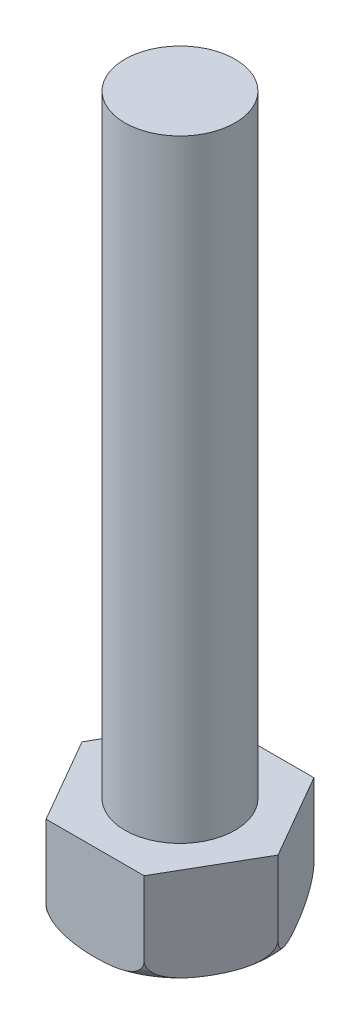
ISO-10303-21;
HEADER;
FILE_DESCRIPTION(('STEP AP214'),'2;1');
FILE_NAME('part.step','',(''),(''),'','','');
FILE_SCHEMA(('AUTOMOTIVE_DESIGN { 1 0 10303 214 1 1 1 1 }'));
ENDSEC;
DATA;
#1=APPLICATION_CONTEXT('core data for automotive mechanical design processes');
#2=APPLICATION_PROTOCOL_DEFINITION('international standard','automotive_design',2000,#1);
#3=PRODUCT_CONTEXT('',#1,'mechanical');
#4=PRODUCT('Part','Part','',(#3));
#5=PRODUCT_RELATED_PRODUCT_CATEGORY('part','',(#4));
#6=PRODUCT_DEFINITION_FORMATION('','',#4);
#7=PRODUCT_DEFINITION_CONTEXT('part definition',#1,'design');
#8=PRODUCT_DEFINITION('design','',#6,#7);
#9=PRODUCT_DEFINITION_SHAPE('','',#8);
#10=(LENGTH_UNIT() NAMED_UNIT(*) SI_UNIT(.MILLI.,.METRE.));
#11=(NAMED_UNIT(*) PLANE_ANGLE_UNIT() SI_UNIT($,.RADIAN.));
#12=(NAMED_UNIT(*) SI_UNIT($,.STERADIAN.) SOLID_ANGLE_UNIT());
#13=UNCERTAINTY_MEASURE_WITH_UNIT(LENGTH_MEASURE(1.E-05),#10,'distance_accuracy_value','');
#14=(GEOMETRIC_REPRESENTATION_CONTEXT(3) GLOBAL_UNCERTAINTY_ASSIGNED_CONTEXT((#13)) GLOBAL_UNIT_ASSIGNED_CONTEXT((#10,
#11,#12)) REPRESENTATION_CONTEXT('',''));
#15=CARTESIAN_POINT('',(0.,0.,0.));
#16=DIRECTION('',(0.,0.,1.));
#17=DIRECTION('',(1.,0.,0.));
#18=AXIS2_PLACEMENT_3D('',#15,#16,#17);
#19=CARTESIAN_POINT('',(2.,2.,3.46410161513776));
#20=DIRECTION('',(-0.866025403784439,0.,-0.5));
#21=DIRECTION('',(-0.5,0.,0.866025403784439));
#22=AXIS2_PLACEMENT_3D('',#19,#20,#21);
#23=PLANE('',#22);
#24=CARTESIAN_POINT('',(3.99999998,-0.999799999999993,3.4641015269765E-08));
#25=CARTESIAN_POINT('',(4.00003769355503,-1.0294536093304,-6.52871524300997E-05));
#26=CARTESIAN_POINT('',(3.99869491994556,-1.05904393467507,0.00226046496223699));
#27=CARTESIAN_POINT('',(3.99352084217814,-1.11711329918436,0.0112222305377141));
#28=CARTESIAN_POINT('',(3.9897090207318,-1.14559920364047,0.0178244989521611));
#29=CARTESIAN_POINT('',(3.97987356941548,-1.20089524674015,0.0348600003473939));
#30=CARTESIAN_POINT('',(3.97385519966756,-1.2277091946836,0.0452841225295287));
#31=CARTESIAN_POINT('',(3.9599647438329,-1.27937784094687,0.0693430977754584));
#32=CARTESIAN_POINT('',(3.952088897878,-1.30422842703919,0.0829844631219197));
#33=CARTESIAN_POINT('',(3.92992122190164,-1.36531200492862,0.121380004198706));
#34=CARTESIAN_POINT('',(3.91453215955728,-1.39995229577925,0.148034642059977));
#35=CARTESIAN_POINT('',(3.8812327480967,-1.4639653382167,0.205710914571851));
#36=CARTESIAN_POINT('',(3.86331632901706,-1.49332500933867,0.236743062707486));
#37=CARTESIAN_POINT('',(3.81371727415776,-1.56469280539847,0.322651145731191));
#38=CARTESIAN_POINT('',(3.78059833853165,-1.6026739157863,0.380014824928211));
#39=CARTESIAN_POINT('',(3.71201181058704,-1.6686030031342,0.498810176043008));
#40=CARTESIAN_POINT('',(3.67653963588347,-1.6965306812471,0.560249784884554));
#41=CARTESIAN_POINT('',(3.59311590915477,-1.75220983888473,0.704743918135409));
#42=CARTESIAN_POINT('',(3.54471445039966,-1.77720482350107,0.788577703859716));
#43=CARTESIAN_POINT('',(3.4469121993743,-1.81791777083726,0.957976171730243));
#44=CARTESIAN_POINT('',(3.39750947854509,-1.83361562819381,1.04354419423858));
#45=CARTESIAN_POINT('',(3.2979055921377,-1.85834502302417,1.21606318612748));
#46=CARTESIAN_POINT('',(3.24770120085363,-1.8673222890499,1.30301974259456));
#47=CARTESIAN_POINT('',(3.14718726120481,-1.87999819485021,1.47711499293523));
#48=CARTESIAN_POINT('',(3.09687786382033,-1.8837019915599,1.56425342530332));
#49=CARTESIAN_POINT('',(2.99210907603092,-1.88666528127134,1.74571828880199));
#50=CARTESIAN_POINT('',(2.93764700946631,-1.88553624805071,1.84004935517709));
#51=CARTESIAN_POINT('',(2.8287592290783,-1.87769445654465,2.02864852313252));
#52=CARTESIAN_POINT('',(2.77433360822454,-1.87097603333138,2.12291646368472));
#53=CARTESIAN_POINT('',(2.66630274072533,-1.85058962527744,2.31003141497909));
#54=CARTESIAN_POINT('',(2.61269456195732,-1.83698648152041,2.40288350430652));
#55=CARTESIAN_POINT('',(2.50633787039546,-1.80020847568392,2.5870986978166));
#56=CARTESIAN_POINT('',(2.45358776568521,-1.77705412478318,2.67846455927933));
#57=CARTESIAN_POINT('',(2.37469514473668,-1.73118918230529,2.81511058710446));
#58=CARTESIAN_POINT('',(2.34782908302074,-1.71350420809442,2.86164397099574));
#59=CARTESIAN_POINT('',(2.29492349294623,-1.67340558145344,2.9532791410092));
#60=CARTESIAN_POINT('',(2.26888535068185,-1.65098443471485,2.99837852634581));
#61=CARTESIAN_POINT('',(2.21800374140216,-1.60021031870618,3.08650805878912));
#62=CARTESIAN_POINT('',(2.1931717607565,-1.57181042475761,3.12951831091996));
#63=CARTESIAN_POINT('',(2.14585580486226,-1.50801132315523,3.21147195053748));
#64=CARTESIAN_POINT('',(2.1233663229526,-1.47262912380164,3.25042487584091));
#65=CARTESIAN_POINT('',(2.08970622917838,-1.40820757200572,3.30872586844538));
#66=CARTESIAN_POINT('',(2.07739812145149,-1.38155818982645,3.33004413637339));
#67=CARTESIAN_POINT('',(2.05485703619781,-1.32488623447538,3.3690864412905));
#68=CARTESIAN_POINT('',(2.04462421364669,-1.29486340964565,3.38681020985388));
#69=CARTESIAN_POINT('',(2.02678564982677,-1.23127190718865,3.41770750872404));
#70=CARTESIAN_POINT('',(2.019215991679,-1.19766201472431,3.43081854123191));
#71=CARTESIAN_POINT('',(2.00762928345183,-1.1281070051883,3.45088730857384));
#72=CARTESIAN_POINT('',(2.00359948428235,-1.09217077310686,3.45786712547968));
#73=CARTESIAN_POINT('',(2.00104008532065,-1.04655195354397,3.46230013451818));
#74=CARTESIAN_POINT('',(2.00064874484981,-1.03721592493249,3.46297795609674));
#75=CARTESIAN_POINT('',(2.00012818405383,-1.01852151322576,3.46387959384379));
#76=CARTESIAN_POINT('',(1.99999877233185,-1.00916315145992,3.46410374152137));
#77=CARTESIAN_POINT('',(2.00000001999962,-0.999800000000077,3.46410158049739));
#78=B_SPLINE_CURVE_WITH_KNOTS('',3,(#24,#25,#26,#27,#28,#29,#30,#31,#32,#33,#34,#35,#36,#37,#38,
#39,#40,#41,#42,#43,#44,#45,#46,#47,#48,#49,#50,#51,#52,#53,#54,#55,#56,#57,#58,#59,#60,#61,#62,
#63,#64,#65,#66,#67,#68,#69,#70,#71,#72,#73,#74,#75,#76,#77),.UNSPECIFIED.,.F.,.F.,(4,2,2,2,2,2,
2,2,2,2,2,2,2,2,2,2,2,2,2,2,2,2,2,2,2,2,4),(0.,0.0887361114342578,0.176780417867086,
0.264616188585346,0.352631304320079,0.490849899159736,0.6294062923063,0.857171561613405,
1.08539416508819,1.38460055557564,1.68445164987327,1.98669878847312,2.28865015557106,
2.6153130533973,2.94230743271619,3.26627790941311,3.58955625315636,3.75909446382873,
3.92890298118487,4.10009756109824,4.27088016170792,4.37940328507182,4.48793450961378,
4.59788420530626,4.70743626518575,4.73553285026018,4.76360889714513),.UNSPECIFIED.);
#79=CARTESIAN_POINT('',(4.,-0.999999999999993,0.));
#80=VERTEX_POINT('',#79);
#81=CARTESIAN_POINT('',(2.,-1.00000000000029,3.46410161513776));
#82=VERTEX_POINT('',#81);
#83=EDGE_CURVE('E95',#80,#82,#78,.T.);
#84=ORIENTED_EDGE('',*,*,#83,.F.);
#85=DIRECTION('',(0.,-1.,0.));
#86=VECTOR('',#85,1.);
#87=CARTESIAN_POINT('',(4.,2.,0.));
#88=LINE('',#87,#86);
#89=CARTESIAN_POINT('',(4.,2.,0.));
#90=VERTEX_POINT('',#89);
#91=EDGE_CURVE('E11',#90,#80,#88,.T.);
#92=ORIENTED_EDGE('',*,*,#91,.F.);
#93=DIRECTION('',(0.5,0.,-0.866025403784439));
#94=VECTOR('',#93,1.);
#95=CARTESIAN_POINT('',(2.,2.,3.46410161513776));
#96=LINE('',#95,#94);
#97=CARTESIAN_POINT('',(2.,2.,3.46410161513776));
#98=VERTEX_POINT('',#97);
#99=EDGE_CURVE('E246',#98,#90,#96,.T.);
#100=ORIENTED_EDGE('',*,*,#99,.F.);
#101=DIRECTION('',(0.,-1.,0.));
#102=VECTOR('',#101,1.);
#103=CARTESIAN_POINT('',(2.,2.,3.46410161513776));
#104=LINE('',#103,#102);
#105=EDGE_CURVE('E47',#98,#82,#104,.T.);
#106=ORIENTED_EDGE('',*,*,#105,.T.);
#107=EDGE_LOOP('',(#84,#92,#100,#106));
#108=FACE_BOUND('',#107,.T.);
#109=ADVANCED_FACE('F32',(#108),#23,.F.);
#110=CARTESIAN_POINT('',(4.,2.,0.));
#111=DIRECTION('',(-0.866025403784438,0.,0.5));
#112=DIRECTION('',(0.5,0.,0.866025403784438));
#113=AXIS2_PLACEMENT_3D('',#110,#111,#112);
#114=PLANE('',#113);
#115=CARTESIAN_POINT('',(2.00000002,-0.999799999999993,-3.46410158049674));
#116=CARTESIAN_POINT('',(1.99996230644497,-1.0294536093304,-3.46416690229019));
#117=CARTESIAN_POINT('',(2.00130508005444,-1.05904393467507,-3.46184115017552));
#118=CARTESIAN_POINT('',(2.00647915782186,-1.11711329918437,-3.45287938460004));
#119=CARTESIAN_POINT('',(2.0102909792682,-1.14559920364047,-3.44627711618559));
#120=CARTESIAN_POINT('',(2.02012643058452,-1.20089524674015,-3.42924161479036));
#121=CARTESIAN_POINT('',(2.02614480033244,-1.2277091946836,-3.41881749260823));
#122=CARTESIAN_POINT('',(2.0400352561671,-1.27937784094687,-3.3947585173623));
#123=CARTESIAN_POINT('',(2.047911102122,-1.30422842703919,-3.38111715201583));
#124=CARTESIAN_POINT('',(2.07007877809836,-1.36531200492862,-3.34272161093905));
#125=CARTESIAN_POINT('',(2.08546784044272,-1.39995229577925,-3.31606697307778));
#126=CARTESIAN_POINT('',(2.1187672519033,-1.4639653382167,-3.2583907005659));
#127=CARTESIAN_POINT('',(2.13668367098294,-1.49332500933867,-3.22735855243027));
#128=CARTESIAN_POINT('',(2.18628272584224,-1.56469280539847,-3.14145046940656));
#129=CARTESIAN_POINT('',(2.21940166146835,-1.60267391578629,-3.08408679020955));
#130=CARTESIAN_POINT('',(2.28798818941295,-1.6686030031342,-2.96529143909475));
#131=CARTESIAN_POINT('',(2.32346036411653,-1.6965306812471,-2.9038518302532));
#132=CARTESIAN_POINT('',(2.40688409084523,-1.75220983888473,-2.75935769700235));
#133=CARTESIAN_POINT('',(2.45528554960034,-1.77720482350107,-2.67552391127804));
#134=CARTESIAN_POINT('',(2.5530878006257,-1.81791777083726,-2.50612544340751));
#135=CARTESIAN_POINT('',(2.60249052145491,-1.83361562819381,-2.42055742089918));
#136=CARTESIAN_POINT('',(2.70209440786229,-1.85834502302417,-2.24803842901028));
#137=CARTESIAN_POINT('',(2.75229879914636,-1.8673222890499,-2.1610818725432));
#138=CARTESIAN_POINT('',(2.85281273879518,-1.87999819485021,-1.98698662220253));
#139=CARTESIAN_POINT('',(2.90312213617966,-1.8837019915599,-1.89984818983444));
#140=CARTESIAN_POINT('',(3.00789092396907,-1.88666528127134,-1.71838332633578));
#141=CARTESIAN_POINT('',(3.06235299053369,-1.88553624805071,-1.62405225996067));
#142=CARTESIAN_POINT('',(3.17124077092169,-1.87769445654465,-1.43545309200524));
#143=CARTESIAN_POINT('',(3.22566639177546,-1.87097603333138,-1.34118515145304));
#144=CARTESIAN_POINT('',(3.33369725927466,-1.85058962527745,-1.15407020015868));
#145=CARTESIAN_POINT('',(3.38730543804267,-1.83698648152041,-1.06121811083125));
#146=CARTESIAN_POINT('',(3.49366212960454,-1.80020847568392,-0.877002917321169));
#147=CARTESIAN_POINT('',(3.54641223431479,-1.77705412478318,-0.785637055858435));
#148=CARTESIAN_POINT('',(3.62530485526332,-1.7311891823053,-0.648991028033313));
#149=CARTESIAN_POINT('',(3.65217091697925,-1.71350420809442,-0.60245764414203));
#150=CARTESIAN_POINT('',(3.70507650705376,-1.67340558145345,-0.51082247412857));
#151=CARTESIAN_POINT('',(3.73111464931814,-1.65098443471485,-0.465723088791956));
#152=CARTESIAN_POINT('',(3.78199625859784,-1.60021031870618,-0.377593556348648));
#153=CARTESIAN_POINT('',(3.8068282392435,-1.57181042475761,-0.334583304217802));
#154=CARTESIAN_POINT('',(3.85414419513774,-1.50801132315524,-0.252629664600287));
#155=CARTESIAN_POINT('',(3.8766336770474,-1.47262912380164,-0.213676739296852));
#156=CARTESIAN_POINT('',(3.91029377082161,-1.40820757200573,-0.155375746692383));
#157=CARTESIAN_POINT('',(3.92260187854851,-1.38155818982646,-0.134057478764369));
#158=CARTESIAN_POINT('',(3.94514296380219,-1.32488623447539,-0.0950151738472583));
#159=CARTESIAN_POINT('',(3.95537578635331,-1.29486340964565,-0.0772914052838764));
#160=CARTESIAN_POINT('',(3.97321435017323,-1.23127190718866,-0.0463941064137193));
#161=CARTESIAN_POINT('',(3.980784008321,-1.19766201472431,-0.033283073905844));
#162=CARTESIAN_POINT('',(3.99237071654817,-1.1281070051883,-0.013214306563918));
#163=CARTESIAN_POINT('',(3.99640051571765,-1.09217077310687,-0.00623448965807337));
#164=CARTESIAN_POINT('',(3.99895991467935,-1.04655195354398,-0.00180148061957516));
#165=CARTESIAN_POINT('',(3.99935125515019,-1.03721592493249,-0.00112365904101704));
#166=CARTESIAN_POINT('',(3.99987181594617,-1.01852151322576,-0.000222021293960387));
#167=CARTESIAN_POINT('',(4.00000122766815,-1.00916315145992,2.12638361310059E-06));
#168=CARTESIAN_POINT('',(3.99999998000038,-0.999800000000077,-3.46403657905351E-08));
#169=B_SPLINE_CURVE_WITH_KNOTS('',3,(#115,#116,#117,#118,#119,#120,#121,#122,#123,#124,#125,
#126,#127,#128,#129,#130,#131,#132,#133,#134,#135,#136,#137,#138,#139,#140,#141,#142,#143,#144,
#145,#146,#147,#148,#149,#150,#151,#152,#153,#154,#155,#156,#157,#158,#159,#160,#161,#162,#163,
#164,#165,#166,#167,#168),.UNSPECIFIED.,.F.,.F.,(4,2,2,2,2,2,2,2,2,2,2,2,2,2,2,2,2,2,2,2,2,2,2,
2,2,2,4),(0.,0.0887361114342579,0.176780417867087,0.264616188585346,0.352631304320079,
0.490849899159736,0.629406292306299,0.857171561613403,1.08539416508819,1.38460055557564,
1.68445164987327,1.98669878847312,2.28865015557105,2.61531305339729,2.94230743271618,
3.2662779094131,3.58955625315634,3.75909446382871,3.92890298118485,4.10009756109823,
4.27088016170791,4.37940328507182,4.48793450961378,4.59788420530625,4.70743626518575,
4.73553285026018,4.76360889714513),.UNSPECIFIED.);
#170=CARTESIAN_POINT('',(2.,-0.999999999999993,-3.46410161513776));
#171=VERTEX_POINT('',#170);
#172=EDGE_CURVE('E89',#171,#80,#169,.T.);
#173=ORIENTED_EDGE('',*,*,#172,.F.);
#174=DIRECTION('',(0.,-1.,0.));
#175=VECTOR('',#174,1.);
#176=CARTESIAN_POINT('',(2.,2.,-3.46410161513776));
#177=LINE('',#176,#175);
#178=CARTESIAN_POINT('',(2.,2.,-3.46410161513776));
#179=VERTEX_POINT('',#178);
#180=EDGE_CURVE('E40',#179,#171,#177,.T.);
#181=ORIENTED_EDGE('',*,*,#180,.F.);
#182=DIRECTION('',(-0.5,0.,-0.866025403784438));
#183=VECTOR('',#182,1.);
#184=CARTESIAN_POINT('',(4.,2.,0.));
#185=LINE('',#184,#183);
#186=EDGE_CURVE('E90',#90,#179,#185,.T.);
#187=ORIENTED_EDGE('',*,*,#186,.F.);
#188=ORIENTED_EDGE('',*,*,#91,.T.);
#189=EDGE_LOOP('',(#173,#181,#187,#188));
#190=FACE_BOUND('',#189,.T.);
#191=ADVANCED_FACE('F87',(#190),#114,.F.);
#192=CARTESIAN_POINT('',(2.,2.,-3.46410161513776));
#193=DIRECTION('',(0.,0.,1.));
#194=DIRECTION('',(1.,0.,0.));
#195=AXIS2_PLACEMENT_3D('',#192,#193,#194);
#196=PLANE('',#195);
#197=CARTESIAN_POINT('',(0.,-1.88578196573792,-3.46410161513776));
#198=CARTESIAN_POINT('',(0.0871249228286692,-1.88578395256707,-3.46410161513776));
#199=CARTESIAN_POINT('',(0.174252200309302,-1.88408021712438,-3.46410161513776));
#200=CARTESIAN_POINT('',(0.348395614722931,-1.87702925099314,-3.46410161513776));
#201=CARTESIAN_POINT('',(0.435411702626604,-1.87168075679749,-3.46410161513776));
#202=CARTESIAN_POINT('',(0.608853264550692,-1.85662395697333,-3.46410161513776));
#203=CARTESIAN_POINT('',(0.695279684344258,-1.84692697273539,-3.46410161513776));
#204=CARTESIAN_POINT('',(0.867292950712586,-1.82193338082857,-3.46410161513776));
#205=CARTESIAN_POINT('',(0.952880418091985,-1.80664129479528,-3.46410161513776));
#206=CARTESIAN_POINT('',(1.10483668592575,-1.77252566998724,-3.46410161513776));
#207=CARTESIAN_POINT('',(1.1715110665876,-1.7550916404833,-3.46410161513776));
#208=CARTESIAN_POINT('',(1.30317946016339,-1.71419426925014,-3.46410161513776));
#209=CARTESIAN_POINT('',(1.36817019173574,-1.69072000503419,-3.46410161513776));
#210=CARTESIAN_POINT('',(1.49569319704026,-1.63579778220682,-3.46410161513776));
#211=CARTESIAN_POINT('',(1.55818685241048,-1.60425796599257,-3.46410161513776));
#212=CARTESIAN_POINT('',(1.67710088561677,-1.53127789459737,-3.46410161513776));
#213=CARTESIAN_POINT('',(1.73354679673769,-1.4898818501805,-3.46410161513776));
#214=CARTESIAN_POINT('',(1.81099551192477,-1.4180056485894,-3.46410161513776));
#215=CARTESIAN_POINT('',(1.83599297579858,-1.39184331947833,-3.46410161513776));
#216=CARTESIAN_POINT('',(1.882007732892,-1.336166684286,-3.46410161513776));
#217=CARTESIAN_POINT('',(1.90302526054367,-1.30665257580012,-3.46410161513776));
#218=CARTESIAN_POINT('',(1.94000345040773,-1.24407330076495,-3.46410161513776));
#219=CARTESIAN_POINT('',(1.95590095784063,-1.21097005520072,-3.46410161513776));
#220=CARTESIAN_POINT('',(1.98083858120289,-1.14227069486415,-3.46410161513776));
#221=CARTESIAN_POINT('',(1.98989060475856,-1.10667902707051,-3.46410161513776));
#222=CARTESIAN_POINT('',(1.99944403825372,-1.03928168688012,-3.46410161513776));
#223=CARTESIAN_POINT('',(2.00093733323497,-1.00761597920041,-3.46410161513776));
#224=CARTESIAN_POINT('',(1.99791948194014,-0.944573998968925,-3.46410161513776));
#225=CARTESIAN_POINT('',(1.99340899629595,-0.913197694954846,-3.46410161513776));
#226=CARTESIAN_POINT('',(1.9795523933244,-0.854924188436214,-3.46410161513776));
#227=CARTESIAN_POINT('',(1.97074340994803,-0.827895554107911,-3.46410161513776));
#228=CARTESIAN_POINT('',(1.94920372640824,-0.77546848729833,-3.46410161513776));
#229=CARTESIAN_POINT('',(1.93647224635541,-0.750070380220783,-3.46410161513776));
#230=CARTESIAN_POINT('',(1.90123407422556,-0.690149230103577,-3.46410161513776));
#231=CARTESIAN_POINT('',(1.87691064998589,-0.656695201290524,-3.46410161513776));
#232=CARTESIAN_POINT('',(1.82323581762198,-0.594090293515358,-3.46410161513776));
#233=CARTESIAN_POINT('',(1.79387157843146,-0.564950758330404,-3.46410161513776));
#234=CARTESIAN_POINT('',(1.71428624416548,-0.495685230306645,-3.46410161513776));
#235=CARTESIAN_POINT('',(1.66155183054612,-0.458468917183322,-3.46410161513776));
#236=CARTESIAN_POINT('',(1.55123067100409,-0.392350366309614,-3.46410161513776));
#237=CARTESIAN_POINT('',(1.49363727832475,-0.363459764011241,-3.46410161513776));
#238=CARTESIAN_POINT('',(1.37775257672273,-0.313276639998611,-3.46410161513776));
#239=CARTESIAN_POINT('',(1.31956136080846,-0.291747657601745,-3.46410161513776));
#240=CARTESIAN_POINT('',(1.20154688596613,-0.253663574313437,-3.46410161513776));
#241=CARTESIAN_POINT('',(1.14172201726752,-0.237113587846448,-3.46410161513776));
#242=CARTESIAN_POINT('',(1.02077746655571,-0.207955419887608,-3.46410161513776));
#243=CARTESIAN_POINT('',(0.959652332380408,-0.195370348704079,-3.46410161513776));
#244=CARTESIAN_POINT('',(0.83685940653933,-0.173503026901619,-3.46410161513776));
#245=CARTESIAN_POINT('',(0.775191901882514,-0.164219125844875,-3.46410161513776));
#246=CARTESIAN_POINT('',(0.639572708834472,-0.146814643592683,-3.46410161513776));
#247=CARTESIAN_POINT('',(0.565548958924671,-0.1392651129505,-3.46410161513776));
#248=CARTESIAN_POINT('',(0.417240291240085,-0.127278816397505,-3.46410161513776));
#249=CARTESIAN_POINT('',(0.342955309381054,-0.122842876925933,-3.46410161513776));
#250=CARTESIAN_POINT('',(0.19411999797424,-0.116640255607737,-3.46410161513776));
#251=CARTESIAN_POINT('',(0.119569439364124,-0.114879231050698,-3.46410161513776));
#252=CARTESIAN_POINT('',(-0.0295380936190255,-0.113863442238166,-3.46410161513776));
#253=CARTESIAN_POINT('',(-0.104095065791178,-0.114608341934519,-3.46410161513776));
#254=CARTESIAN_POINT('',(-0.252796786809467,-0.11867121760842,-3.46410161513776));
#255=CARTESIAN_POINT('',(-0.326941850639115,-0.12197730768877,-3.46410161513776));
#256=CARTESIAN_POINT('',(-0.475071284897797,-0.131480635057039,-3.46410161513776));
#257=CARTESIAN_POINT('',(-0.549055612393172,-0.137678567450038,-3.46410161513776));
#258=CARTESIAN_POINT('',(-0.696453231839083,-0.153543424366581,-3.46410161513776));
#259=CARTESIAN_POINT('',(-0.769867537354856,-0.163200703705126,-3.46410161513776));
#260=CARTESIAN_POINT('',(-0.915976209333154,-0.186865764363061,-3.46410161513776));
#261=CARTESIAN_POINT('',(-0.988671008748835,-0.200870741628497,-3.46410161513776));
#262=CARTESIAN_POINT('',(-1.10148260758842,-0.227171316081175,-3.46410161513776));
#263=CARTESIAN_POINT('',(-1.1420418088249,-0.237569511374801,-3.46410161513776));
#264=CARTESIAN_POINT('',(-1.22259020389978,-0.260444640006425,-3.46410161513776));
#265=CARTESIAN_POINT('',(-1.26257922097441,-0.272922203390059,-3.46410161513776));
#266=CARTESIAN_POINT('',(-1.34164194074244,-0.300248396931883,-3.46410161513776));
#267=CARTESIAN_POINT('',(-1.38071759797768,-0.315091304530041,-3.46410161513776));
#268=CARTESIAN_POINT('',(-1.45769180740462,-0.347540702900852,-3.46410161513776));
#269=CARTESIAN_POINT('',(-1.4955909128525,-0.365145870439355,-3.46410161513776));
#270=CARTESIAN_POINT('',(-1.57973245465371,-0.408718592665765,-3.46410161513776));
#271=CARTESIAN_POINT('',(-1.62548087247623,-0.435662072607575,-3.46410161513776));
#272=CARTESIAN_POINT('',(-1.71285544847332,-0.495667692636133,-3.46410161513776));
#273=CARTESIAN_POINT('',(-1.7544851255661,-0.528724539144224,-3.46410161513776));
#274=CARTESIAN_POINT('',(-1.82045460371143,-0.591536378316095,-3.46410161513776));
#275=CARTESIAN_POINT('',(-1.84637088896581,-0.619621925686689,-3.46410161513776));
#276=CARTESIAN_POINT('',(-1.89352065156396,-0.679494177123281,-3.46410161513776));
#277=CARTESIAN_POINT('',(-1.91476186878825,-0.711274628642956,-3.46410161513776));
#278=CARTESIAN_POINT('',(-1.94744704383778,-0.771601551781109,-3.46410161513776));
#279=CARTESIAN_POINT('',(-1.95999784795779,-0.799544248561098,-3.46410161513776));
#280=CARTESIAN_POINT('',(-1.98029178688695,-0.857136083829635,-3.46410161513776));
#281=CARTESIAN_POINT('',(-1.98803810202331,-0.88678407926161,-3.46410161513776));
#282=CARTESIAN_POINT('',(-1.9981318977691,-0.947154400760398,-3.46410161513776));
#283=CARTESIAN_POINT('',(-2.00045214072553,-0.977881364354719,-3.46410161513776));
#284=CARTESIAN_POINT('',(-1.99940134941236,-1.03923618093817,-3.46410161513776));
#285=CARTESIAN_POINT('',(-1.99603062749302,-1.06986403927428,-3.46410161513776));
#286=CARTESIAN_POINT('',(-1.98437631275464,-1.1276800417308,-3.46410161513776));
#287=CARTESIAN_POINT('',(-1.9764929858814,-1.15495097948054,-3.46410161513776));
#288=CARTESIAN_POINT('',(-1.95668064966459,-1.207967001541,-3.46410161513776));
#289=CARTESIAN_POINT('',(-1.94475014845102,-1.23371151906543,-3.46410161513776));
#290=CARTESIAN_POINT('',(-1.91188761918932,-1.29350066056435,-3.46410161513776));
#291=CARTESIAN_POINT('',(-1.88927062636952,-1.32661832039988,-3.46410161513776));
#292=CARTESIAN_POINT('',(-1.8390261423537,-1.38879552563673,-3.46410161513776));
#293=CARTESIAN_POINT('',(-1.81138789886642,-1.41784612094732,-3.46410161513776));
#294=CARTESIAN_POINT('',(-1.73689341849603,-1.48643825259136,-3.46410161513776));
#295=CARTESIAN_POINT('',(-1.68763120267892,-1.52334756103701,-3.46410161513776));
#296=CARTESIAN_POINT('',(-1.5841689247597,-1.58935011889918,-3.46410161513776));
#297=CARTESIAN_POINT('',(-1.52995744348462,-1.61842464852747,-3.46410161513776));
#298=CARTESIAN_POINT('',(-1.42178454989761,-1.66870056847276,-3.46410161513776));
#299=CARTESIAN_POINT('',(-1.36798370622532,-1.69025525365937,-3.46410161513776));
#300=CARTESIAN_POINT('',(-1.25872520634312,-1.72872931379232,-3.46410161513776));
#301=CARTESIAN_POINT('',(-1.20326599636359,-1.74564418039303,-3.46410161513776));
#302=CARTESIAN_POINT('',(-1.09126586822636,-1.77569457800588,-3.46410161513776));
#303=CARTESIAN_POINT('',(-1.034723490001,-1.78882455933399,-3.46410161513776));
#304=CARTESIAN_POINT('',(-0.920999396306344,-1.81196391642854,-3.46410161513776));
#305=CARTESIAN_POINT('',(-0.863817500598245,-1.82197238824908,-3.46410161513776));
#306=CARTESIAN_POINT('',(-0.739791756909376,-1.84082024338869,-3.46410161513776));
#307=CARTESIAN_POINT('',(-0.672880465931506,-1.84920901147217,-3.46410161513776));
#308=CARTESIAN_POINT('',(-0.538762421576342,-1.8631513602603,-3.46410161513776));
#309=CARTESIAN_POINT('',(-0.471555625555084,-1.86870451724846,-3.46410161513776));
#310=CARTESIAN_POINT('',(-0.336990511517283,-1.87741649064903,-3.46410161513776));
#311=CARTESIAN_POINT('',(-0.269632193353994,-1.88057530474158,-3.46410161513776));
#312=CARTESIAN_POINT('',(-0.134849721644682,-1.88475730977531,-3.46410161513776));
#313=CARTESIAN_POINT('',(-0.067425565939229,-1.88578042814023,-3.46410161513776));
#314=CARTESIAN_POINT('',(0.,-1.88578196573792,-3.46410161513776));
#315=B_SPLINE_CURVE_WITH_KNOTS('',3,(#197,#198,#199,#200,#201,#202,#203,#204,#205,#206,#207,
#208,#209,#210,#211,#212,#213,#214,#215,#216,#217,#218,#219,#220,#221,#222,#223,#224,#225,#226,
#227,#228,#229,#230,#231,#232,#233,#234,#235,#236,#237,#238,#239,#240,#241,#242,#243,#244,#245,
#246,#247,#248,#249,#250,#251,#252,#253,#254,#255,#256,#257,#258,#259,#260,#261,#262,#263,#264,
#265,#266,#267,#268,#269,#270,#271,#272,#273,#274,#275,#276,#277,#278,#279,#280,#281,#282,#283,
#284,#285,#286,#287,#288,#289,#290,#291,#292,#293,#294,#295,#296,#297,#298,#299,#300,#301,#302,
#303,#304,#305,#306,#307,#308,#309,#310,#311,#312,#313,#314),.UNSPECIFIED.,.T.,.F.,(4,2,2,2,2,2,
2,2,2,2,2,2,2,2,2,2,2,2,2,2,2,2,2,2,2,2,2,2,2,2,2,2,2,2,2,2,2,2,2,2,2,2,2,2,2,2,2,2,2,2,2,2,2,2,
2,2,2,2,4),(0.,0.26136107555247,0.522812801734771,0.78358774927832,1.04415241749465,
1.25069443186499,1.45761259113395,1.66700130486283,1.87546792193514,1.9837274656075,
2.09198063043201,2.2015220427617,2.31087246820004,2.40541533726109,2.49994780406466,
2.58488770446807,2.66984450393653,2.79322970280077,2.91693375833551,3.10947540119441,
3.3022848366326,3.48814012923847,3.67418568562628,3.86129639959992,4.04831343459568,
4.27145287072807,4.49465151229585,4.71832155195037,4.94196159831714,5.16456995457406,
5.38723184624558,5.60927769407515,5.83118062960236,5.95674899213404,6.082355471113,
6.20766255483071,6.33290979363856,6.49180646372679,6.6505661836119,6.76484910341379,
6.87894137290433,6.97046556862306,7.06192911514078,7.15385081150131,7.24576746287688,
7.33057286816406,7.41540956846329,7.53504490203343,7.65493950359139,7.83856746366379,
8.02263035572589,8.19624242314812,8.37002259041054,8.54405628600962,8.71814033266117,
8.92036915487099,9.12262818666403,9.32488741442369,9.52715351534483),.UNSPECIFIED.);
#316=CARTESIAN_POINT('',(-2.,-0.999999999999993,-3.46410161513775));
#317=VERTEX_POINT('',#316);
#318=EDGE_CURVE('E99',#317,#171,#315,.T.);
#319=ORIENTED_EDGE('',*,*,#318,.F.);
#320=DIRECTION('',(0.,-1.,0.));
#321=VECTOR('',#320,1.);
#322=CARTESIAN_POINT('',(-2.,2.,-3.46410161513776));
#323=LINE('',#322,#321);
#324=CARTESIAN_POINT('',(-2.,2.,-3.46410161513776));
#325=VERTEX_POINT('',#324);
#326=EDGE_CURVE('E263',#325,#317,#323,.T.);
#327=ORIENTED_EDGE('',*,*,#326,.F.);
#328=DIRECTION('',(-1.,0.,0.));
#329=VECTOR('',#328,1.);
#330=CARTESIAN_POINT('',(2.,2.,-3.46410161513776));
#331=LINE('',#330,#329);
#332=EDGE_CURVE('E248',#179,#325,#331,.T.);
#333=ORIENTED_EDGE('',*,*,#332,.F.);
#334=ORIENTED_EDGE('',*,*,#180,.T.);
#335=EDGE_LOOP('',(#319,#327,#333,#334));
#336=FACE_BOUND('',#335,.T.);
#337=ADVANCED_FACE('F148',(#336),#196,.F.);
#338=CARTESIAN_POINT('',(-2.,2.,-3.46410161513776));
#339=DIRECTION('',(0.866025403784439,0.,0.5));
#340=DIRECTION('',(0.5,0.,-0.866025403784439));
#341=AXIS2_PLACEMENT_3D('',#338,#339,#340);
#342=PLANE('',#341);
#343=CARTESIAN_POINT('',(-3.99999998,-0.999799999999993,-3.46410152659629E-08));
#344=CARTESIAN_POINT('',(-4.00003769355503,-1.0294536093304,6.52871524300903E-05));
#345=CARTESIAN_POINT('',(-3.99869491994556,-1.05904393467507,-0.002260464962237));
#346=CARTESIAN_POINT('',(-3.99352084217814,-1.11711329918436,-0.0112222305377141));
#347=CARTESIAN_POINT('',(-3.9897090207318,-1.14559920364047,-0.0178244989521611));
#348=CARTESIAN_POINT('',(-3.97987356941548,-1.20089524674015,-0.0348600003473938));
#349=CARTESIAN_POINT('',(-3.97385519966756,-1.2277091946836,-0.0452841225295287));
#350=CARTESIAN_POINT('',(-3.9599647438329,-1.27937784094687,-0.0693430977754584));
#351=CARTESIAN_POINT('',(-3.952088897878,-1.30422842703919,-0.0829844631219198));
#352=CARTESIAN_POINT('',(-3.92992122190164,-1.36531200492862,-0.121380004198706));
#353=CARTESIAN_POINT('',(-3.91453215955728,-1.39995229577925,-0.148034642059977));
#354=CARTESIAN_POINT('',(-3.8812327480967,-1.4639653382167,-0.205710914571851));
#355=CARTESIAN_POINT('',(-3.86331632901706,-1.49332500933867,-0.236743062707486));
#356=CARTESIAN_POINT('',(-3.81371727415776,-1.56469280539847,-0.322651145731191));
#357=CARTESIAN_POINT('',(-3.78059833853165,-1.6026739157863,-0.380014824928211));
#358=CARTESIAN_POINT('',(-3.71201181058704,-1.6686030031342,-0.498810176043008));
#359=CARTESIAN_POINT('',(-3.67653963588347,-1.6965306812471,-0.560249784884554));
#360=CARTESIAN_POINT('',(-3.59311590915477,-1.75220983888473,-0.70474391813541));
#361=CARTESIAN_POINT('',(-3.54471445039966,-1.77720482350107,-0.788577703859716));
#362=CARTESIAN_POINT('',(-3.4469121993743,-1.81791777083726,-0.957976171730244));
#363=CARTESIAN_POINT('',(-3.39750947854509,-1.83361562819381,-1.04354419423858));
#364=CARTESIAN_POINT('',(-3.2979055921377,-1.85834502302417,-1.21606318612749));
#365=CARTESIAN_POINT('',(-3.24770120085363,-1.8673222890499,-1.30301974259456));
#366=CARTESIAN_POINT('',(-3.14718726120481,-1.87999819485021,-1.47711499293523));
#367=CARTESIAN_POINT('',(-3.09687786382033,-1.8837019915599,-1.56425342530332));
#368=CARTESIAN_POINT('',(-2.99210907603092,-1.88666528127134,-1.74571828880199));
#369=CARTESIAN_POINT('',(-2.93764700946631,-1.88553624805071,-1.84004935517709));
#370=CARTESIAN_POINT('',(-2.8287592290783,-1.87769445654465,-2.02864852313252));
#371=CARTESIAN_POINT('',(-2.77433360822454,-1.87097603333138,-2.12291646368472));
#372=CARTESIAN_POINT('',(-2.66630274072533,-1.85058962527744,-2.31003141497909));
#373=CARTESIAN_POINT('',(-2.61269456195732,-1.8369864815204,-2.40288350430652));
#374=CARTESIAN_POINT('',(-2.50633787039546,-1.80020847568392,-2.5870986978166));
#375=CARTESIAN_POINT('',(-2.4535877656852,-1.77705412478318,-2.67846455927933));
#376=CARTESIAN_POINT('',(-2.37469514473668,-1.73118918230529,-2.81511058710446));
#377=CARTESIAN_POINT('',(-2.34782908302074,-1.71350420809441,-2.86164397099574));
#378=CARTESIAN_POINT('',(-2.29492349294623,-1.67340558145344,-2.9532791410092));
#379=CARTESIAN_POINT('',(-2.26888535068185,-1.65098443471485,-2.99837852634581));
#380=CARTESIAN_POINT('',(-2.21800374140215,-1.60021031870618,-3.08650805878912));
#381=CARTESIAN_POINT('',(-2.1931717607565,-1.57181042475761,-3.12951831091996));
#382=CARTESIAN_POINT('',(-2.14585580486226,-1.50801132315523,-3.21147195053748));
#383=CARTESIAN_POINT('',(-2.1233663229526,-1.47262912380164,-3.25042487584091));
#384=CARTESIAN_POINT('',(-2.08970622917838,-1.40820757200572,-3.30872586844538));
#385=CARTESIAN_POINT('',(-2.07739812145149,-1.38155818982645,-3.33004413637339));
#386=CARTESIAN_POINT('',(-2.05485703619781,-1.32488623447538,-3.3690864412905));
#387=CARTESIAN_POINT('',(-2.04462421364669,-1.29486340964565,-3.38681020985388));
#388=CARTESIAN_POINT('',(-2.02678564982677,-1.23127190718865,-3.41770750872404));
#389=CARTESIAN_POINT('',(-2.019215991679,-1.19766201472431,-3.43081854123191));
#390=CARTESIAN_POINT('',(-2.00762928345183,-1.1281070051883,-3.45088730857384));
#391=CARTESIAN_POINT('',(-2.00359948428235,-1.09217077310686,-3.45786712547968));
#392=CARTESIAN_POINT('',(-2.00104008532065,-1.04655195354397,-3.46230013451818));
#393=CARTESIAN_POINT('',(-2.00064874484981,-1.03721592493249,-3.46297795609674));
#394=CARTESIAN_POINT('',(-2.00012818405384,-1.01852151322576,-3.46387959384379));
#395=CARTESIAN_POINT('',(-1.99999877233185,-1.00916315145992,-3.46410374152137));
#396=CARTESIAN_POINT('',(-2.00000001999963,-0.999800000000077,-3.46410158049739));
#397=B_SPLINE_CURVE_WITH_KNOTS('',3,(#343,#344,#345,#346,#347,#348,#349,#350,#351,#352,#353,
#354,#355,#356,#357,#358,#359,#360,#361,#362,#363,#364,#365,#366,#367,#368,#369,#370,#371,#372,
#373,#374,#375,#376,#377,#378,#379,#380,#381,#382,#383,#384,#385,#386,#387,#388,#389,#390,#391,
#392,#393,#394,#395,#396),.UNSPECIFIED.,.F.,.F.,(4,2,2,2,2,2,2,2,2,2,2,2,2,2,2,2,2,2,2,2,2,2,2,
2,2,2,4),(0.,0.0887361114342578,0.176780417867086,0.264616188585346,0.352631304320079,
0.490849899159736,0.6294062923063,0.857171561613405,1.08539416508819,1.38460055557565,
1.68445164987327,1.98669878847312,2.28865015557106,2.6153130533973,2.94230743271619,
3.26627790941311,3.58955625315636,3.75909446382873,3.92890298118487,4.10009756109824,
4.27088016170792,4.37940328507183,4.48793450961378,4.59788420530626,4.70743626518576,
4.73553285026019,4.76360889714513),.UNSPECIFIED.);
#398=CARTESIAN_POINT('',(-4.,-0.999999999999993,0.));
#399=VERTEX_POINT('',#398);
#400=EDGE_CURVE('E140',#399,#317,#397,.T.);
#401=ORIENTED_EDGE('',*,*,#400,.F.);
#402=DIRECTION('',(0.,-1.,0.));
#403=VECTOR('',#402,1.);
#404=CARTESIAN_POINT('',(-4.,2.,0.));
#405=LINE('',#404,#403);
#406=CARTESIAN_POINT('',(-4.,2.,0.));
#407=VERTEX_POINT('',#406);
#408=EDGE_CURVE('E261',#407,#399,#405,.T.);
#409=ORIENTED_EDGE('',*,*,#408,.F.);
#410=DIRECTION('',(-0.5,0.,0.866025403784439));
#411=VECTOR('',#410,1.);
#412=CARTESIAN_POINT('',(-2.,2.,-3.46410161513776));
#413=LINE('',#412,#411);
#414=EDGE_CURVE('E253',#325,#407,#413,.T.);
#415=ORIENTED_EDGE('',*,*,#414,.F.);
#416=ORIENTED_EDGE('',*,*,#326,.T.);
#417=EDGE_LOOP('',(#401,#409,#415,#416));
#418=FACE_BOUND('',#417,.T.);
#419=ADVANCED_FACE('F151',(#418),#342,.F.);
#420=CARTESIAN_POINT('',(-4.,2.,0.));
#421=DIRECTION('',(0.866025403784439,0.,-0.5));
#422=DIRECTION('',(-0.5,0.,-0.866025403784439));
#423=AXIS2_PLACEMENT_3D('',#420,#421,#422);
#424=PLANE('',#423);
#425=CARTESIAN_POINT('',(-2.00000002,-0.999799999999993,3.46410158049674));
#426=CARTESIAN_POINT('',(-1.99996230644497,-1.0294536093304,3.46416690229018));
#427=CARTESIAN_POINT('',(-2.00130508005444,-1.05904393467507,3.46184115017552));
#428=CARTESIAN_POINT('',(-2.00647915782186,-1.11711329918437,3.45287938460004));
#429=CARTESIAN_POINT('',(-2.0102909792682,-1.14559920364047,3.44627711618559));
#430=CARTESIAN_POINT('',(-2.02012643058452,-1.20089524674015,3.42924161479036));
#431=CARTESIAN_POINT('',(-2.02614480033244,-1.2277091946836,3.41881749260823));
#432=CARTESIAN_POINT('',(-2.0400352561671,-1.27937784094687,3.39475851736229));
#433=CARTESIAN_POINT('',(-2.047911102122,-1.30422842703919,3.38111715201583));
#434=CARTESIAN_POINT('',(-2.07007877809836,-1.36531200492862,3.34272161093905));
#435=CARTESIAN_POINT('',(-2.08546784044272,-1.39995229577925,3.31606697307778));
#436=CARTESIAN_POINT('',(-2.1187672519033,-1.46396533821671,3.2583907005659));
#437=CARTESIAN_POINT('',(-2.13668367098294,-1.49332500933867,3.22735855243027));
#438=CARTESIAN_POINT('',(-2.18628272584225,-1.56469280539847,3.14145046940656));
#439=CARTESIAN_POINT('',(-2.21940166146835,-1.6026739157863,3.08408679020954));
#440=CARTESIAN_POINT('',(-2.28798818941296,-1.6686030031342,2.96529143909474));
#441=CARTESIAN_POINT('',(-2.32346036411653,-1.6965306812471,2.9038518302532));
#442=CARTESIAN_POINT('',(-2.40688409084523,-1.75220983888473,2.75935769700234));
#443=CARTESIAN_POINT('',(-2.45528554960035,-1.77720482350107,2.67552391127804));
#444=CARTESIAN_POINT('',(-2.55308780062571,-1.81791777083726,2.50612544340751));
#445=CARTESIAN_POINT('',(-2.60249052145491,-1.83361562819381,2.42055742089918));
#446=CARTESIAN_POINT('',(-2.7020944078623,-1.85834502302417,2.24803842901027));
#447=CARTESIAN_POINT('',(-2.75229879914637,-1.8673222890499,2.16108187254319));
#448=CARTESIAN_POINT('',(-2.85281273879519,-1.87999819485021,1.98698662220252));
#449=CARTESIAN_POINT('',(-2.90312213617967,-1.8837019915599,1.89984818983443));
#450=CARTESIAN_POINT('',(-3.00789092396908,-1.88666528127134,1.71838332633577));
#451=CARTESIAN_POINT('',(-3.06235299053369,-1.88553624805071,1.62405225996066));
#452=CARTESIAN_POINT('',(-3.1712407709217,-1.87769445654465,1.43545309200523));
#453=CARTESIAN_POINT('',(-3.22566639177546,-1.87097603333138,1.34118515145303));
#454=CARTESIAN_POINT('',(-3.33369725927467,-1.85058962527744,1.15407020015866));
#455=CARTESIAN_POINT('',(-3.38730543804268,-1.8369864815204,1.06121811083123));
#456=CARTESIAN_POINT('',(-3.49366212960455,-1.80020847568392,0.877002917321153));
#457=CARTESIAN_POINT('',(-3.5464122343148,-1.77705412478318,0.785637055858418));
#458=CARTESIAN_POINT('',(-3.62530485526333,-1.73118918230529,0.648991028033296));
#459=CARTESIAN_POINT('',(-3.65217091697926,-1.71350420809441,0.602457644142014));
#460=CARTESIAN_POINT('',(-3.70507650705377,-1.67340558145344,0.510822474128556));
#461=CARTESIAN_POINT('',(-3.73111464931815,-1.65098443471485,0.465723088791943));
#462=CARTESIAN_POINT('',(-3.78199625859785,-1.60021031870618,0.377593556348636));
#463=CARTESIAN_POINT('',(-3.8068282392435,-1.57181042475761,0.334583304217791));
#464=CARTESIAN_POINT('',(-3.85414419513774,-1.50801132315523,0.252629664600278));
#465=CARTESIAN_POINT('',(-3.87663367704741,-1.47262912380164,0.213676739296844));
#466=CARTESIAN_POINT('',(-3.91029377082162,-1.40820757200572,0.155375746692376));
#467=CARTESIAN_POINT('',(-3.92260187854851,-1.38155818982645,0.134057478764363));
#468=CARTESIAN_POINT('',(-3.94514296380219,-1.32488623447538,0.095015173847253));
#469=CARTESIAN_POINT('',(-3.95537578635331,-1.29486340964565,0.0772914052838706));
#470=CARTESIAN_POINT('',(-3.97321435017323,-1.23127190718865,0.0463941064137145));
#471=CARTESIAN_POINT('',(-3.980784008321,-1.1976620147243,0.0332830739058408));
#472=CARTESIAN_POINT('',(-3.99237071654817,-1.1281070051883,0.0132143065639168));
#473=CARTESIAN_POINT('',(-3.99640051571765,-1.09217077310686,0.00623448965807261));
#474=CARTESIAN_POINT('',(-3.99895991467935,-1.04655195354397,0.00180148061957496));
#475=CARTESIAN_POINT('',(-3.99935125515019,-1.03721592493249,0.00112365904101697));
#476=CARTESIAN_POINT('',(-3.99987181594617,-1.01852151322576,0.000222021293960469));
#477=CARTESIAN_POINT('',(-4.00000122766815,-1.00916315145992,-2.12638361301583E-06));
#478=CARTESIAN_POINT('',(-3.99999998000038,-0.999800000000077,3.46403657905353E-08));
#479=B_SPLINE_CURVE_WITH_KNOTS('',3,(#425,#426,#427,#428,#429,#430,#431,#432,#433,#434,#435,
#436,#437,#438,#439,#440,#441,#442,#443,#444,#445,#446,#447,#448,#449,#450,#451,#452,#453,#454,
#455,#456,#457,#458,#459,#460,#461,#462,#463,#464,#465,#466,#467,#468,#469,#470,#471,#472,#473,
#474,#475,#476,#477,#478),.UNSPECIFIED.,.F.,.F.,(4,2,2,2,2,2,2,2,2,2,2,2,2,2,2,2,2,2,2,2,2,2,2,
2,2,2,4),(0.,0.0887361114342582,0.176780417867086,0.264616188585346,0.35263130432008,
0.490849899159737,0.629406292306301,0.857171561613406,1.08539416508819,1.38460055557565,
1.68445164987327,1.98669878847312,2.28865015557106,2.6153130533973,2.9423074327162,
3.26627790941311,3.58955625315636,3.75909446382873,3.92890298118487,4.10009756109824,
4.27088016170792,4.37940328507182,4.48793450961378,4.59788420530626,4.70743626518575,
4.73553285026018,4.76360889714513),.UNSPECIFIED.);
#480=CARTESIAN_POINT('',(-2.,-0.999999999999993,3.46410161513775));
#481=VERTEX_POINT('',#480);
#482=EDGE_CURVE('E133',#481,#399,#479,.T.);
#483=ORIENTED_EDGE('',*,*,#482,.F.);
#484=DIRECTION('',(0.,-1.,0.));
#485=VECTOR('',#484,1.);
#486=CARTESIAN_POINT('',(-2.,2.,3.46410161513775));
#487=LINE('',#486,#485);
#488=CARTESIAN_POINT('',(-2.,2.,3.46410161513775));
#489=VERTEX_POINT('',#488);
#490=EDGE_CURVE('E259',#489,#481,#487,.T.);
#491=ORIENTED_EDGE('',*,*,#490,.F.);
#492=DIRECTION('',(0.5,0.,0.866025403784439));
#493=VECTOR('',#492,1.);
#494=CARTESIAN_POINT('',(-4.,2.,0.));
#495=LINE('',#494,#493);
#496=EDGE_CURVE('E255',#407,#489,#495,.T.);
#497=ORIENTED_EDGE('',*,*,#496,.F.);
#498=ORIENTED_EDGE('',*,*,#408,.T.);
#499=EDGE_LOOP('',(#483,#491,#497,#498));
#500=FACE_BOUND('',#499,.T.);
#501=ADVANCED_FACE('F186',(#500),#424,.F.);
#502=CARTESIAN_POINT('',(-2.,2.,3.46410161513775));
#503=DIRECTION('',(0.,0.,-1.));
#504=DIRECTION('',(-1.,0.,0.));
#505=AXIS2_PLACEMENT_3D('',#502,#503,#504);
#506=PLANE('',#505);
#507=CARTESIAN_POINT('',(0.,-1.8857819657775,3.46410161520319));
#508=CARTESIAN_POINT('',(-0.0871249228277745,-1.88578395261154,3.46410161521127));
#509=CARTESIAN_POINT('',(-0.17425220030751,-1.88408021713634,3.46410161515745));
#510=CARTESIAN_POINT('',(-0.348395614720319,-1.87702925098135,3.46410161511805));
#511=CARTESIAN_POINT('',(-0.435411702624067,-1.87168075679448,3.46410161513248));
#512=CARTESIAN_POINT('',(-0.608853264548836,-1.85662395697671,3.46410161514301));
#513=CARTESIAN_POINT('',(-0.695279684343003,-1.8469269727364,3.46410161513915));
#514=CARTESIAN_POINT('',(-0.867292950712151,-1.8219333808278,3.46410161513636));
#515=CARTESIAN_POINT('',(-0.952880418091772,-1.80664129479513,3.46410161513742));
#516=CARTESIAN_POINT('',(-1.10483668592586,-1.77252566998738,3.46410161513802));
#517=CARTESIAN_POINT('',(-1.1715110665878,-1.75509164048329,3.46410161513783));
#518=CARTESIAN_POINT('',(-1.30317946016359,-1.71419426925002,3.46410161513768));
#519=CARTESIAN_POINT('',(-1.36817019173584,-1.69072000503413,3.46410161513774));
#520=CARTESIAN_POINT('',(-1.49569319704021,-1.63579778220686,3.46410161513777));
#521=CARTESIAN_POINT('',(-1.55818685241039,-1.60425796599262,3.46410161513776));
#522=CARTESIAN_POINT('',(-1.67710088561669,-1.53127789459743,3.46410161513775));
#523=CARTESIAN_POINT('',(-1.73354679673766,-1.48988185018053,3.46410161513775));
#524=CARTESIAN_POINT('',(-1.81099551192478,-1.41800564858939,3.46410161513776));
#525=CARTESIAN_POINT('',(-1.8359929757986,-1.39184331947832,3.46410161513775));
#526=CARTESIAN_POINT('',(-1.88200773289201,-1.33616668428599,3.46410161513775));
#527=CARTESIAN_POINT('',(-1.90302526054368,-1.30665257580011,3.46410161513775));
#528=CARTESIAN_POINT('',(-1.94000345040773,-1.24407330076495,3.46410161513775));
#529=CARTESIAN_POINT('',(-1.95590095784063,-1.21097005520073,3.46410161513775));
#530=CARTESIAN_POINT('',(-1.98083858120289,-1.14227069486415,3.46410161513775));
#531=CARTESIAN_POINT('',(-1.98989060475857,-1.10667902707051,3.46410161513775));
#532=CARTESIAN_POINT('',(-1.99944403825372,-1.03928168688012,3.46410161513775));
#533=CARTESIAN_POINT('',(-2.00093733323497,-1.00761597920041,3.46410161513775));
#534=CARTESIAN_POINT('',(-1.99791948194014,-0.944573998968923,3.46410161513775));
#535=CARTESIAN_POINT('',(-1.99340899629595,-0.913197694954845,3.46410161513775));
#536=CARTESIAN_POINT('',(-1.9795523933244,-0.854924188436214,3.46410161513775));
#537=CARTESIAN_POINT('',(-1.97074340994803,-0.827895554107911,3.46410161513775));
#538=CARTESIAN_POINT('',(-1.94920372640825,-0.775468487298329,3.46410161513775));
#539=CARTESIAN_POINT('',(-1.93647224635541,-0.750070380220783,3.46410161513775));
#540=CARTESIAN_POINT('',(-1.90123407422556,-0.690149230103576,3.46410161513775));
#541=CARTESIAN_POINT('',(-1.87691064998589,-0.656695201290524,3.46410161513775));
#542=CARTESIAN_POINT('',(-1.82323581762198,-0.594090293515358,3.46410161513775));
#543=CARTESIAN_POINT('',(-1.79387157843146,-0.564950758330403,3.46410161513775));
#544=CARTESIAN_POINT('',(-1.71428624416548,-0.495685230306644,3.46410161513775));
#545=CARTESIAN_POINT('',(-1.66155183054612,-0.458468917183321,3.46410161513775));
#546=CARTESIAN_POINT('',(-1.55123067100409,-0.392350366309614,3.46410161513775));
#547=CARTESIAN_POINT('',(-1.49363727832475,-0.36345976401124,3.46410161513775));
#548=CARTESIAN_POINT('',(-1.37775257672273,-0.31327663999861,3.46410161513775));
#549=CARTESIAN_POINT('',(-1.31956136080846,-0.291747657601744,3.46410161513775));
#550=CARTESIAN_POINT('',(-1.20154688596612,-0.253663574313436,3.46410161513775));
#551=CARTESIAN_POINT('',(-1.14172201726752,-0.237113587846447,3.46410161513775));
#552=CARTESIAN_POINT('',(-1.02077746655571,-0.207955419887607,3.46410161513775));
#553=CARTESIAN_POINT('',(-0.959652332380406,-0.195370348704079,3.46410161513775));
#554=CARTESIAN_POINT('',(-0.836859406539327,-0.173503026901618,3.46410161513775));
#555=CARTESIAN_POINT('',(-0.775191901882511,-0.164219125844874,3.46410161513775));
#556=CARTESIAN_POINT('',(-0.639572708834469,-0.146814643592682,3.46410161513775));
#557=CARTESIAN_POINT('',(-0.565548958924667,-0.1392651129505,3.46410161513775));
#558=CARTESIAN_POINT('',(-0.417240291240081,-0.127278816397505,3.46410161513775));
#559=CARTESIAN_POINT('',(-0.342955309381049,-0.122842876925933,3.46410161513775));
#560=CARTESIAN_POINT('',(-0.194119997974235,-0.116640255607736,3.46410161513775));
#561=CARTESIAN_POINT('',(-0.119569439364118,-0.114879231050698,3.46410161513775));
#562=CARTESIAN_POINT('',(0.0295380936190317,-0.113863442238165,3.46410161513775));
#563=CARTESIAN_POINT('',(0.104095065791184,-0.114608341934519,3.46410161513776));
#564=CARTESIAN_POINT('',(0.252796786809475,-0.11867121760842,3.46410161513776));
#565=CARTESIAN_POINT('',(0.326941850639122,-0.121977307688769,3.46410161513776));
#566=CARTESIAN_POINT('',(0.475071284897805,-0.131480635057039,3.46410161513776));
#567=CARTESIAN_POINT('',(0.54905561239318,-0.137678567450038,3.46410161513776));
#568=CARTESIAN_POINT('',(0.696453231839091,-0.153543424366581,3.46410161513776));
#569=CARTESIAN_POINT('',(0.769867537354865,-0.163200703705127,3.46410161513776));
#570=CARTESIAN_POINT('',(0.915976209333164,-0.186865764363062,3.46410161513776));
#571=CARTESIAN_POINT('',(0.988671008748845,-0.200870741628498,3.46410161513776));
#572=CARTESIAN_POINT('',(1.10148260758843,-0.227171316081177,3.46410161513776));
#573=CARTESIAN_POINT('',(1.14204180882491,-0.237569511374803,3.46410161513776));
#574=CARTESIAN_POINT('',(1.22259020389979,-0.260444640006427,3.46410161513776));
#575=CARTESIAN_POINT('',(1.26257922097441,-0.272922203390061,3.46410161513776));
#576=CARTESIAN_POINT('',(1.34164194074245,-0.300248396931884,3.46410161513776));
#577=CARTESIAN_POINT('',(1.38071759797769,-0.315091304530042,3.46410161513776));
#578=CARTESIAN_POINT('',(1.45769180740462,-0.347540702900853,3.46410161513776));
#579=CARTESIAN_POINT('',(1.4955909128525,-0.365145870439356,3.46410161513776));
#580=CARTESIAN_POINT('',(1.57973245465372,-0.408718592665766,3.46410161513776));
#581=CARTESIAN_POINT('',(1.62548087247623,-0.435662072607576,3.46410161513776));
#582=CARTESIAN_POINT('',(1.71285544847332,-0.495667692636135,3.46410161513776));
#583=CARTESIAN_POINT('',(1.7544851255661,-0.528724539144226,3.46410161513776));
#584=CARTESIAN_POINT('',(1.82045460371144,-0.591536378316097,3.46410161513776));
#585=CARTESIAN_POINT('',(1.84637088896581,-0.619621925686692,3.46410161513776));
#586=CARTESIAN_POINT('',(1.89352065156396,-0.679494177123283,3.46410161513776));
#587=CARTESIAN_POINT('',(1.91476186878825,-0.711274628642957,3.46410161513776));
#588=CARTESIAN_POINT('',(1.94744704383778,-0.77160155178111,3.46410161513776));
#589=CARTESIAN_POINT('',(1.95999784795779,-0.799544248561101,3.46410161513776));
#590=CARTESIAN_POINT('',(1.98029178688695,-0.857136083829638,3.46410161513776));
#591=CARTESIAN_POINT('',(1.98803810202331,-0.886784079261612,3.46410161513776));
#592=CARTESIAN_POINT('',(1.99813189776911,-0.9471544007604,3.46410161513776));
#593=CARTESIAN_POINT('',(2.00045214072553,-0.97788136435472,3.46410161513776));
#594=CARTESIAN_POINT('',(1.99940134941236,-1.03923618093817,3.46410161513776));
#595=CARTESIAN_POINT('',(1.99603062749302,-1.06986403927428,3.46410161513776));
#596=CARTESIAN_POINT('',(1.98437631275464,-1.1276800417308,3.46410161513776));
#597=CARTESIAN_POINT('',(1.9764929858814,-1.15495097948055,3.46410161513776));
#598=CARTESIAN_POINT('',(1.95668064966459,-1.20796700154101,3.46410161513776));
#599=CARTESIAN_POINT('',(1.94475014845102,-1.23371151906543,3.46410161513776));
#600=CARTESIAN_POINT('',(1.91188761918932,-1.29350066056434,3.46410161513776));
#601=CARTESIAN_POINT('',(1.88927062636953,-1.32661832039986,3.46410161513776));
#602=CARTESIAN_POINT('',(1.83902614235371,-1.38879552563671,3.46410161513776));
#603=CARTESIAN_POINT('',(1.81138789886643,-1.41784612094731,3.46410161513776));
#604=CARTESIAN_POINT('',(1.73689341849599,-1.4864382525914,3.46410161513776));
#605=CARTESIAN_POINT('',(1.68763120267883,-1.52334756103708,3.46410161513775));
#606=CARTESIAN_POINT('',(1.58416892475959,-1.58935011889924,3.46410161513776));
#607=CARTESIAN_POINT('',(1.52995744348456,-1.61842464852749,3.46410161513776));
#608=CARTESIAN_POINT('',(1.42178454989774,-1.6687005684727,3.46410161513775));
#609=CARTESIAN_POINT('',(1.36798370622559,-1.69025525365926,3.46410161513775));
#610=CARTESIAN_POINT('',(1.25872520634363,-1.72872931379216,3.46410161513776));
#611=CARTESIAN_POINT('',(1.2032659963642,-1.74564418039286,3.46410161513777));
#612=CARTESIAN_POINT('',(1.09126586822697,-1.77569457800573,3.46410161513774));
#613=CARTESIAN_POINT('',(1.03472349000151,-1.78882455933384,3.46410161513769));
#614=CARTESIAN_POINT('',(0.920999396306613,-1.81196391642853,3.46410161513782));
#615=CARTESIAN_POINT('',(0.863817500598375,-1.8219723882492,3.464101615138));
#616=CARTESIAN_POINT('',(0.739791756909199,-1.84082024338855,3.46410161513747));
#617=CARTESIAN_POINT('',(0.672880465931159,-1.84920901147153,3.46410161513662));
#618=CARTESIAN_POINT('',(0.538762421575431,-1.86315136026107,3.46410161513889));
#619=CARTESIAN_POINT('',(0.471555625553778,-1.86870451725114,3.464101615142));
#620=CARTESIAN_POINT('',(0.336990511515481,-1.87741649064656,3.46410161513351));
#621=CARTESIAN_POINT('',(0.269632193352092,-1.88057530473206,3.4641016151219));
#622=CARTESIAN_POINT('',(0.134849721643347,-1.88475730978493,3.46410161515361));
#623=CARTESIAN_POINT('',(0.0674255659385606,-1.88578042817603,3.46410161519694));
#624=CARTESIAN_POINT('',(0.,-1.8857819657775,3.46410161520319));
#625=B_SPLINE_CURVE_WITH_KNOTS('',3,(#507,#508,#509,#510,#511,#512,#513,#514,#515,#516,#517,
#518,#519,#520,#521,#522,#523,#524,#525,#526,#527,#528,#529,#530,#531,#532,#533,#534,#535,#536,
#537,#538,#539,#540,#541,#542,#543,#544,#545,#546,#547,#548,#549,#550,#551,#552,#553,#554,#555,
#556,#557,#558,#559,#560,#561,#562,#563,#564,#565,#566,#567,#568,#569,#570,#571,#572,#573,#574,
#575,#576,#577,#578,#579,#580,#581,#582,#583,#584,#585,#586,#587,#588,#589,#590,#591,#592,#593,
#594,#595,#596,#597,#598,#599,#600,#601,#602,#603,#604,#605,#606,#607,#608,#609,#610,#611,#612,
#613,#614,#615,#616,#617,#618,#619,#620,#621,#622,#623,#624),.UNSPECIFIED.,.T.,.F.,(4,2,2,2,2,2,
2,2,2,2,2,2,2,2,2,2,2,2,2,2,2,2,2,2,2,2,2,2,2,2,2,2,2,2,2,2,2,2,2,2,2,2,2,2,2,2,2,2,2,2,2,2,2,2,
2,2,2,2,4),(0.,0.261361075550785,0.522812801733037,0.783587749278461,1.04415241749544,
1.2506944318661,1.45761259113474,1.66700130486347,1.87546792193593,1.98372746560832,
2.0919806304328,2.20152204276249,2.31087246820083,2.40541533726188,2.49994780406545,
2.58488770446887,2.66984450393732,2.79322970280156,2.9169337583363,3.1094754011952,
3.3022848366334,3.48814012923926,3.67418568562707,3.86129639960071,4.04831343459648,
4.27145287072887,4.49465151229664,4.71832155195116,4.94196159831794,5.16456995457486,
5.38723184624638,5.60927769407595,5.83118062960316,5.95674899213484,6.08235547111379,
6.20766255483151,6.33290979363936,6.49180646372759,6.6505661836127,6.76484910341459,
6.87894137290513,6.97046556862386,7.06192911514157,7.1538508115021,7.24576746287767,
7.33057286816486,7.41540956846409,7.53504490203419,7.65493950359219,7.83856746366475,
8.02263035572669,8.19624242314847,8.3700225904106,8.54405628601,8.71814033266198,
8.9203691548723,9.12262818666657,9.32488741442632,9.52715351534624),.UNSPECIFIED.);
#626=EDGE_CURVE('E125',#82,#481,#625,.T.);
#627=ORIENTED_EDGE('',*,*,#626,.F.);
#628=ORIENTED_EDGE('',*,*,#105,.F.);
#629=DIRECTION('',(1.,0.,0.));
#630=VECTOR('',#629,1.);
#631=CARTESIAN_POINT('',(-2.,2.,3.46410161513775));
#632=LINE('',#631,#630);
#633=EDGE_CURVE('E55',#489,#98,#632,.T.);
#634=ORIENTED_EDGE('',*,*,#633,.F.);
#635=ORIENTED_EDGE('',*,*,#490,.T.);
#636=EDGE_LOOP('',(#627,#628,#634,#635));
#637=FACE_BOUND('',#636,.T.);
#638=ADVANCED_FACE('F195',(#637),#506,.F.);
#639=CARTESIAN_POINT('',(0.,2.,0.));
#640=DIRECTION('',(0.,1.,0.));
#641=DIRECTION('',(0.,0.,1.));
#642=AXIS2_PLACEMENT_3D('',#639,#640,#641);
#643=PLANE('',#642);
#644=CARTESIAN_POINT('',(0.,2.,0.));
#645=DIRECTION('',(0.,1.,0.));
#646=DIRECTION('',(0.,0.,1.));
#647=AXIS2_PLACEMENT_3D('',#644,#645,#646);
#648=CIRCLE('',#647,2.25);
#649=CARTESIAN_POINT('',(0.,2.,2.25));
#650=VERTEX_POINT('',#649);
#651=EDGE_CURVE('E101',#650,#650,#648,.T.);
#652=ORIENTED_EDGE('',*,*,#651,.F.);
#653=EDGE_LOOP('',(#652));
#654=FACE_BOUND('',#653,.T.);
#655=ORIENTED_EDGE('',*,*,#99,.T.);
#656=ORIENTED_EDGE('',*,*,#186,.T.);
#657=ORIENTED_EDGE('',*,*,#332,.T.);
#658=ORIENTED_EDGE('',*,*,#414,.T.);
#659=ORIENTED_EDGE('',*,*,#496,.T.);
#660=ORIENTED_EDGE('',*,*,#633,.T.);
#661=EDGE_LOOP('',(#655,#656,#657,#658,#659,#660));
#662=FACE_BOUND('',#661,.T.);
#663=ADVANCED_FACE('F204',(#654,#662),#643,.T.);
#664=CARTESIAN_POINT('',(0.,27.,0.));
#665=DIRECTION('',(0.,-1.,0.));
#666=DIRECTION('',(0.,0.,-1.));
#667=AXIS2_PLACEMENT_3D('',#664,#665,#666);
#668=CYLINDRICAL_SURFACE('',#667,2.25);
#669=CARTESIAN_POINT('',(0.,27.,0.));
#670=DIRECTION('',(0.,1.,0.));
#671=DIRECTION('',(0.,0.,1.));
#672=AXIS2_PLACEMENT_3D('',#669,#670,#671);
#673=CIRCLE('',#672,2.25);
#674=CARTESIAN_POINT('',(0.,27.,2.25));
#675=VERTEX_POINT('',#674);
#676=EDGE_CURVE('E104',#675,#675,#673,.T.);
#677=ORIENTED_EDGE('',*,*,#676,.F.);
#678=EDGE_LOOP('',(#677));
#679=FACE_BOUND('',#678,.T.);
#680=ORIENTED_EDGE('',*,*,#651,.T.);
#681=EDGE_LOOP('',(#680));
#682=FACE_BOUND('',#681,.T.);
#683=ADVANCED_FACE('F226',(#679,#682),#668,.T.);
#684=CARTESIAN_POINT('',(0.,27.,0.));
#685=DIRECTION('',(0.,1.,0.));
#686=DIRECTION('',(0.,0.,1.));
#687=AXIS2_PLACEMENT_3D('',#684,#685,#686);
#688=PLANE('',#687);
#689=ORIENTED_EDGE('',*,*,#676,.T.);
#690=EDGE_LOOP('',(#689));
#691=FACE_BOUND('',#690,.T.);
#692=ADVANCED_FACE('F119',(#691),#688,.T.);
#693=CARTESIAN_POINT('',(0.,-1.,0.));
#694=DIRECTION('',(0.,1.,0.));
#695=DIRECTION('',(0.,0.,1.));
#696=AXIS2_PLACEMENT_3D('',#693,#694,#695);
#697=TOROIDAL_SURFACE('',#696,3.,1.);
#698=CARTESIAN_POINT('',(0.,-2.,0.));
#699=DIRECTION('',(0.,1.,0.));
#700=DIRECTION('',(0.,0.,1.));
#701=AXIS2_PLACEMENT_3D('',#698,#699,#700);
#702=CIRCLE('',#701,2.99999999999999);
#703=CARTESIAN_POINT('',(0.,-2.,2.99999999999999));
#704=VERTEX_POINT('',#703);
#705=EDGE_CURVE('E273',#704,#704,#702,.T.);
#706=ORIENTED_EDGE('',*,*,#705,.T.);
#707=EDGE_LOOP('',(#706));
#708=FACE_BOUND('',#707,.T.);
#709=ORIENTED_EDGE('',*,*,#83,.T.);
#710=ORIENTED_EDGE('',*,*,#626,.T.);
#711=ORIENTED_EDGE('',*,*,#482,.T.);
#712=ORIENTED_EDGE('',*,*,#400,.T.);
#713=ORIENTED_EDGE('',*,*,#318,.T.);
#714=ORIENTED_EDGE('',*,*,#172,.T.);
#715=EDGE_LOOP('',(#709,#710,#711,#712,#713,#714));
#716=FACE_BOUND('',#715,.T.);
#717=ADVANCED_FACE('F93',(#708,#716),#697,.T.);
#718=CARTESIAN_POINT('',(0.,-2.,0.));
#719=DIRECTION('',(0.,1.,0.));
#720=DIRECTION('',(0.,0.,1.));
#721=AXIS2_PLACEMENT_3D('',#718,#719,#720);
#722=PLANE('',#721);
#723=ORIENTED_EDGE('',*,*,#705,.F.);
#724=EDGE_LOOP('',(#723));
#725=FACE_BOUND('',#724,.T.);
#726=ADVANCED_FACE('F118',(#725),#722,.F.);
#727=CLOSED_SHELL('',(#109,#191,#337,#419,#501,#638,#663,#683,#692,#717,#726));
#728=MANIFOLD_SOLID_BREP('B2',#727);
#729=ADVANCED_BREP_SHAPE_REPRESENTATION('',(#18,#728),#14);
#730=SHAPE_DEFINITION_REPRESENTATION(#9,#729);
ENDSEC;
END-ISO-10303-21;
